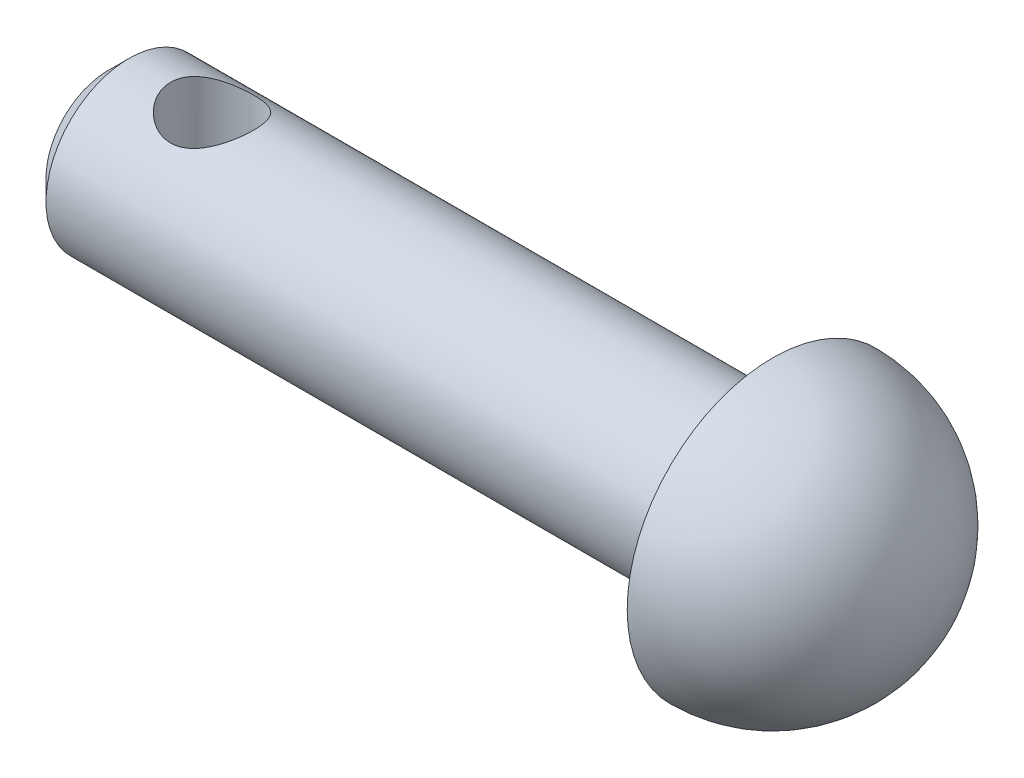
ISO-10303-21;
HEADER;
FILE_DESCRIPTION(('STEP AP214'),'2;1');
FILE_NAME('part.step','',(''),(''),'','','');
FILE_SCHEMA(('AUTOMOTIVE_DESIGN { 1 0 10303 214 1 1 1 1 }'));
ENDSEC;
DATA;
#1=APPLICATION_CONTEXT('core data for automotive mechanical design processes');
#2=APPLICATION_PROTOCOL_DEFINITION('international standard','automotive_design',2000,#1);
#3=PRODUCT_CONTEXT('',#1,'mechanical');
#4=PRODUCT('Part','Part','',(#3));
#5=PRODUCT_RELATED_PRODUCT_CATEGORY('part','',(#4));
#6=PRODUCT_DEFINITION_FORMATION('','',#4);
#7=PRODUCT_DEFINITION_CONTEXT('part definition',#1,'design');
#8=PRODUCT_DEFINITION('design','',#6,#7);
#9=PRODUCT_DEFINITION_SHAPE('','',#8);
#10=(LENGTH_UNIT() NAMED_UNIT(*) SI_UNIT(.MILLI.,.METRE.));
#11=(NAMED_UNIT(*) PLANE_ANGLE_UNIT() SI_UNIT($,.RADIAN.));
#12=(NAMED_UNIT(*) SI_UNIT($,.STERADIAN.) SOLID_ANGLE_UNIT());
#13=UNCERTAINTY_MEASURE_WITH_UNIT(LENGTH_MEASURE(1.E-05),#10,'distance_accuracy_value','');
#14=(GEOMETRIC_REPRESENTATION_CONTEXT(3) GLOBAL_UNCERTAINTY_ASSIGNED_CONTEXT((#13)) GLOBAL_UNIT_ASSIGNED_CONTEXT((#10,
#11,#12)) REPRESENTATION_CONTEXT('',''));
#15=CARTESIAN_POINT('',(0.,0.,0.));
#16=DIRECTION('',(0.,0.,1.));
#17=DIRECTION('',(1.,0.,0.));
#18=AXIS2_PLACEMENT_3D('',#15,#16,#17);
#19=CARTESIAN_POINT('',(16.,0.,0.));
#20=DIRECTION('',(-1.,0.,0.));
#21=DIRECTION('',(0.,0.,1.));
#22=AXIS2_PLACEMENT_3D('',#19,#20,#21);
#23=CYLINDRICAL_SURFACE('',#22,2.);
#24=CARTESIAN_POINT('',(1.5,-2.,0.));
#25=CARTESIAN_POINT('',(1.5000033023195,-1.99999713404151,0.0525719629529865));
#26=CARTESIAN_POINT('',(1.50417007312168,-1.99790491019518,0.105206599698033));
#27=CARTESIAN_POINT('',(1.52065288034092,-1.98974156037396,0.208920235268425));
#28=CARTESIAN_POINT('',(1.53298439299765,-1.98366287828984,0.259996086713504));
#29=CARTESIAN_POINT('',(1.56519380861679,-1.96816279403312,0.358933544880574));
#30=CARTESIAN_POINT('',(1.58504238424801,-1.9587543917752,0.40680680293918));
#31=CARTESIAN_POINT('',(1.63157062136494,-1.93745776515779,0.498472616806565));
#32=CARTESIAN_POINT('',(1.65824974424885,-1.9255697363353,0.54226549399005));
#33=CARTESIAN_POINT('',(1.7195172494853,-1.89956258258057,0.62750781776192));
#34=CARTESIAN_POINT('',(1.75448647923964,-1.88535199127536,0.668655211122112));
#35=CARTESIAN_POINT('',(1.83052147924703,-1.85659970246744,0.744779444866978));
#36=CARTESIAN_POINT('',(1.87159185177244,-1.84205776209035,0.779751583106767));
#37=CARTESIAN_POINT('',(1.96248334952338,-1.81298951197347,0.845252000450279));
#38=CARTESIAN_POINT('',(2.01273609834591,-1.79855186970132,0.875225335551638));
#39=CARTESIAN_POINT('',(2.11836733598622,-1.77285978772321,0.926168226890696));
#40=CARTESIAN_POINT('',(2.17374212872275,-1.7616030760699,0.947144214966334));
#41=CARTESIAN_POINT('',(2.28466510542192,-1.74457867037808,0.978132442188589));
#42=CARTESIAN_POINT('',(2.3400044520674,-1.73852271583714,0.988725857080441));
#43=CARTESIAN_POINT('',(2.45197883777948,-1.73181889948528,1.00042699330885));
#44=CARTESIAN_POINT('',(2.50861254087116,-1.73116569343288,1.00154408837307));
#45=CARTESIAN_POINT('',(2.61428602431537,-1.73510930257248,0.994687287172295));
#46=CARTESIAN_POINT('',(2.66342403122305,-1.73908763662014,0.987784559536822));
#47=CARTESIAN_POINT('',(2.75972190937304,-1.7507622873385,0.966939849056933));
#48=CARTESIAN_POINT('',(2.80688114530532,-1.75845978831776,0.952995623897652));
#49=CARTESIAN_POINT('',(2.89922913256566,-1.77687476412741,0.918209780386004));
#50=CARTESIAN_POINT('',(2.94434639878579,-1.78765840663999,0.897215067115995));
#51=CARTESIAN_POINT('',(3.03063429259001,-1.81103404281404,0.849041687668002));
#52=CARTESIAN_POINT('',(3.07180313560009,-1.82362684780191,0.821860243812467));
#53=CARTESIAN_POINT('',(3.15452125274323,-1.85113157903286,0.758066054912789));
#54=CARTESIAN_POINT('',(3.19545687357616,-1.86613510236746,0.720694458369282));
#55=CARTESIAN_POINT('',(3.2707354185909,-1.89547623300407,0.639555578741373));
#56=CARTESIAN_POINT('',(3.30507519203388,-1.90981351958801,0.595785256574285));
#57=CARTESIAN_POINT('',(3.36768566102973,-1.93701987282964,0.500516505831848));
#58=CARTESIAN_POINT('',(3.39560047244574,-1.94978984162007,0.448753591599408));
#59=CARTESIAN_POINT('',(3.44209702904301,-1.97157881121242,0.340466215488797));
#60=CARTESIAN_POINT('',(3.46068618501517,-1.98060078943553,0.283945576265276));
#61=CARTESIAN_POINT('',(3.48647540371668,-1.99324333741436,0.172766491660702));
#62=CARTESIAN_POINT('',(3.49449123574678,-1.99724938301312,0.118341530548324));
#63=CARTESIAN_POINT('',(3.50146473113449,-2.00073013459102,0.00877959994935378));
#64=CARTESIAN_POINT('',(3.50042668563948,-2.00020698721312,-0.0463570198699013));
#65=CARTESIAN_POINT('',(3.48979331158125,-1.99491192253441,-0.151232971985994));
#66=CARTESIAN_POINT('',(3.48086746726997,-1.9904724568819,-0.201059408049954));
#67=CARTESIAN_POINT('',(3.45576192810492,-1.97822171314819,-0.298406892301917));
#68=CARTESIAN_POINT('',(3.43958143354664,-1.97041006334332,-0.345927685690997));
#69=CARTESIAN_POINT('',(3.40000153356683,-1.95184251413669,-0.438888608449665));
#70=CARTESIAN_POINT('',(3.37640894988319,-1.94100881769939,-0.484230397006154));
#71=CARTESIAN_POINT('',(3.32289246435396,-1.91743974317109,-0.570461361698921));
#72=CARTESIAN_POINT('',(3.29296586540657,-1.90470355565785,-0.611348629775282));
#73=CARTESIAN_POINT('',(3.22423957466713,-1.87708221337464,-0.691767689290653));
#74=CARTESIAN_POINT('',(3.18485713154644,-1.86210884848441,-0.730772077824639));
#75=CARTESIAN_POINT('',(3.1000748487307,-1.83262391603874,-0.80185632111324));
#76=CARTESIAN_POINT('',(3.05467088118363,-1.81811267381526,-0.833931385690841));
#77=CARTESIAN_POINT('',(2.95635634579969,-1.79051192226068,-0.891707914497696));
#78=CARTESIAN_POINT('',(2.90318873379141,-1.77752529663472,-0.917025495878638));
#79=CARTESIAN_POINT('',(2.79248993230748,-1.75574072368126,-0.958082826013803));
#80=CARTESIAN_POINT('',(2.73496447349881,-1.74693738240618,-0.97383491588757));
#81=CARTESIAN_POINT('',(2.62308977713855,-1.73561501008667,-0.993861687449679));
#82=CARTESIAN_POINT('',(2.56896574657096,-1.73257383460491,-0.999092996400865));
#83=CARTESIAN_POINT('',(2.46055293282927,-1.73165354646175,-1.00068915438079));
#84=CARTESIAN_POINT('',(2.40626423126057,-1.73377219627553,-0.997057846624399));
#85=CARTESIAN_POINT('',(2.30451649846799,-1.74237862050025,-0.981926125592263));
#86=CARTESIAN_POINT('',(2.2568995298556,-1.74843094482394,-0.9712083143428));
#87=CARTESIAN_POINT('',(2.16419188057529,-1.76371016187918,-0.943175358224645));
#88=CARTESIAN_POINT('',(2.11910201790803,-1.77293807569676,-0.92585809115981));
#89=CARTESIAN_POINT('',(2.02937514901339,-1.79428530364528,-0.883815745300683));
#90=CARTESIAN_POINT('',(1.9849720981703,-1.80655722396191,-0.858671137816458));
#91=CARTESIAN_POINT('',(1.90072546381941,-1.8323533163459,-0.802150971636634));
#92=CARTESIAN_POINT('',(1.86088426948151,-1.84587813794522,-0.770772171238648));
#93=CARTESIAN_POINT('',(1.78185801764238,-1.87462323159313,-0.698203326664641));
#94=CARTESIAN_POINT('',(1.74334089763808,-1.88984983311469,-0.656284423010172));
#95=CARTESIAN_POINT('',(1.67373701657637,-1.91877752255088,-0.56615480622028));
#96=CARTESIAN_POINT('',(1.64265426057371,-1.9324777860804,-0.517940723256785));
#97=CARTESIAN_POINT('',(1.5887636372378,-1.95698009585103,-0.415931596819947));
#98=CARTESIAN_POINT('',(1.56601583058857,-1.96776096562909,-0.362099503934615));
#99=CARTESIAN_POINT('',(1.53019183208105,-1.98501341363465,-0.250742101294192));
#100=CARTESIAN_POINT('',(1.51708815317042,-1.99149723372932,-0.193227799623166));
#101=CARTESIAN_POINT('',(1.50610258892415,-1.99695461909663,-0.112601946483384));
#102=CARTESIAN_POINT('',(1.50381735913638,-1.99809365339202,-0.0901618794394987));
#103=CARTESIAN_POINT('',(1.50076533448319,-1.99961696977865,-0.0451517318071577));
#104=CARTESIAN_POINT('',(1.4999985815288,-2.00000123103763,-0.0225816476473814));
#105=CARTESIAN_POINT('',(1.5,-2.,0.));
#106=B_SPLINE_CURVE_WITH_KNOTS('',3,(#24,#25,#26,#27,#28,#29,#30,#31,#32,#33,#34,#35,#36,#37,
#38,#39,#40,#41,#42,#43,#44,#45,#46,#47,#48,#49,#50,#51,#52,#53,#54,#55,#56,#57,#58,#59,#60,#61,
#62,#63,#64,#65,#66,#67,#68,#69,#70,#71,#72,#73,#74,#75,#76,#77,#78,#79,#80,#81,#82,#83,#84,#85,
#86,#87,#88,#89,#90,#91,#92,#93,#94,#95,#96,#97,#98,#99,#100,#101,#102,#103,#104,#105),
.UNSPECIFIED.,.T.,.F.,(4,2,2,2,2,2,2,2,2,2,2,2,2,2,2,2,2,2,2,2,2,2,2,2,2,2,2,2,2,2,2,2,2,2,2,2,
2,2,2,2,4),(0.,0.157624257420293,0.315548149709198,0.472862155492298,0.630163760581568,
0.79698175871809,0.963926237654036,1.14381726430753,1.32357947898281,1.4925801214023,
1.6614135732902,1.81005712409321,1.95874803925679,2.11090240168487,2.26312521260222,
2.43464941333879,2.60625534598686,2.78583022214441,2.9652621691228,3.12983290471346,
3.29432564511476,3.44606906506122,3.59782921630932,3.75392856027899,3.91009450748339,
4.08159610644419,4.25321588615432,4.43314682159674,4.61284511940778,4.77529307498374,
4.93767059860005,5.08457930244183,5.23153528783678,5.38836456775614,5.54527561138958,
5.72125242752498,5.89732383376573,6.07464013662925,6.2514490862493,6.31915280137698,
6.38685838514847),.UNSPECIFIED.);
#107=CARTESIAN_POINT('',(1.5,-2.,0.));
#108=VERTEX_POINT('',#107);
#109=EDGE_CURVE('E10',#108,#108,#106,.T.);
#110=ORIENTED_EDGE('',*,*,#109,.T.);
#111=EDGE_LOOP('',(#110));
#112=FACE_BOUND('',#111,.T.);
#113=CARTESIAN_POINT('',(2.5,1.73205080756888,1.));
#114=CARTESIAN_POINT('',(2.44789219180475,1.73205534728459,0.999996363074532));
#115=CARTESIAN_POINT('',(2.39571858847495,1.73443801187756,0.995899970733217));
#116=CARTESIAN_POINT('',(2.29297273532285,1.74362366452052,0.979723209898053));
#117=CARTESIAN_POINT('',(2.24240408495659,1.75043594055559,0.967626064554179));
#118=CARTESIAN_POINT('',(2.14454833565606,1.76749346605398,0.936099948699812));
#119=CARTESIAN_POINT('',(2.09724534752641,1.77772043473252,0.916709952493731));
#120=CARTESIAN_POINT('',(2.00657579800328,1.80042664816858,0.871267525376372));
#121=CARTESIAN_POINT('',(1.96320944973754,1.81290601476065,0.845214734035773));
#122=CARTESIAN_POINT('',(1.87769427144249,1.83996869057441,0.784666540530879));
#123=CARTESIAN_POINT('',(1.83594086432646,1.85464063637954,0.749652036143771));
#124=CARTESIAN_POINT('',(1.75859161159329,1.88371982785706,0.673253807614468));
#125=CARTESIAN_POINT('',(1.72299883741648,1.8981269383125,0.631866925782293));
#126=CARTESIAN_POINT('',(1.65663284885234,1.92621476952949,0.540489563414546));
#127=CARTESIAN_POINT('',(1.62634623214047,1.93978106418172,0.490107189012575));
#128=CARTESIAN_POINT('',(1.57485914675424,1.96350756099529,0.384157026599504));
#129=CARTESIAN_POINT('',(1.55365294386283,1.97366991183742,0.328592538138155));
#130=CARTESIAN_POINT('',(1.5224953386989,1.98880461244237,0.218044943925977));
#131=CARTESIAN_POINT('',(1.51185047364447,1.99409480220892,0.163301790488817));
#132=CARTESIAN_POINT('',(1.49983388132496,2.00007583846067,0.0525706286978481));
#133=CARTESIAN_POINT('',(1.49845654320429,2.0007694678459,-0.00341660584373847));
#134=CARTESIAN_POINT('',(1.50474667397035,1.9976298191645,-0.10983252442375));
#135=CARTESIAN_POINT('',(1.51163801552122,1.9941849589216,-0.160321199176791));
#136=CARTESIAN_POINT('',(1.53288084390466,1.98374245259747,-0.259313771918322));
#137=CARTESIAN_POINT('',(1.54723288897622,1.97674454066394,-0.307817521093925));
#138=CARTESIAN_POINT('',(1.58308256608981,1.95971583287654,-0.402309391569554));
#139=CARTESIAN_POINT('',(1.60467631317207,1.94964441529199,-0.448253423515178));
#140=CARTESIAN_POINT('',(1.65426341620149,1.92737645986687,-0.535976801513329));
#141=CARTESIAN_POINT('',(1.68225906330235,1.91517916157484,-0.577754648838646));
#142=CARTESIAN_POINT('',(1.74689535153302,1.88844394399229,-0.660173660898195));
#143=CARTESIAN_POINT('',(1.78410302832601,1.87379375998175,-0.70033407502936));
#144=CARTESIAN_POINT('',(1.86458972493018,1.84454340586812,-0.77410437029778));
#145=CARTESIAN_POINT('',(1.90787337227406,1.82994328265629,-0.807709211574231));
#146=CARTESIAN_POINT('',(2.00264819242409,1.80144156092485,-0.869505334642211));
#147=CARTESIAN_POINT('',(2.05448602305421,1.78764319990708,-0.897217314978052));
#148=CARTESIAN_POINT('',(2.162937671359,1.76375450278576,-0.943319113001232));
#149=CARTESIAN_POINT('',(2.21954643301756,1.75366030046067,-0.96171865821089));
#150=CARTESIAN_POINT('',(2.33121451128279,1.73944635817034,-0.987180211025041));
#151=CARTESIAN_POINT('',(2.38604111904355,1.73491655848496,-0.995025122119976));
#152=CARTESIAN_POINT('',(2.49640134151654,1.73117919361609,-1.00151694661143));
#153=CARTESIAN_POINT('',(2.55193442911979,1.73196786889312,-1.00017035731503));
#154=CARTESIAN_POINT('',(2.65565391857873,1.73834336540585,-0.989036043343966));
#155=CARTESIAN_POINT('',(2.70397945110793,1.74339587506654,-0.980187816712467));
#156=CARTESIAN_POINT('',(2.79836778627096,1.75694021551341,-0.955696284632441));
#157=CARTESIAN_POINT('',(2.84442985074661,1.76543316005034,-0.940050778623615));
#158=CARTESIAN_POINT('',(2.9354113309027,1.78536222079657,-0.901647588604886));
#159=CARTESIAN_POINT('',(2.98017901685355,1.79691643243063,-0.878594063692724));
#160=CARTESIAN_POINT('',(3.06546927153899,1.8215611949725,-0.826287064015804));
#161=CARTESIAN_POINT('',(3.10598964351328,1.83465253355148,-0.797030404332216));
#162=CARTESIAN_POINT('',(3.18697876752355,1.86287998456336,-0.728837167198854));
#163=CARTESIAN_POINT('',(3.22679715071766,1.87806583154289,-0.689145272314967));
#164=CARTESIAN_POINT('',(3.29941223799359,1.90734234977892,-0.603404495398289));
#165=CARTESIAN_POINT('',(3.33220657023054,1.92143265007709,-0.557353474655347));
#166=CARTESIAN_POINT('',(3.3905737259501,1.94741361690957,-0.458535362558757));
#167=CARTESIAN_POINT('',(3.41593311821091,1.95923641672029,-0.405623097574113));
#168=CARTESIAN_POINT('',(3.45713790385739,1.97883354959301,-0.295522364641082));
#169=CARTESIAN_POINT('',(3.47299165136631,1.98661143676373,-0.238337701392176));
#170=CARTESIAN_POINT('',(3.49336856417466,1.99667508181883,-0.126979682330417));
#171=CARTESIAN_POINT('',(3.49879787587611,1.99939927908191,-0.0730114438504572));
#172=CARTESIAN_POINT('',(3.5008432654544,2.00042130375131,0.0351259859512035));
#173=CARTESIAN_POINT('',(3.49746242852356,1.9987206806689,0.0892951002950867));
#174=CARTESIAN_POINT('',(3.48258359320438,1.99133968837923,0.192537992317147));
#175=CARTESIAN_POINT('',(3.47163515074233,1.9859289466799,0.241712317811263));
#176=CARTESIAN_POINT('',(3.44267300069703,1.97192093663423,0.337445952183617));
#177=CARTESIAN_POINT('',(3.42465827990655,1.96332321132796,0.384004884955508));
#178=CARTESIAN_POINT('',(3.38127294783403,1.9432593074812,0.475423406244885));
#179=CARTESIAN_POINT('',(3.35562067679216,1.93168617198799,0.520125142700046));
#180=CARTESIAN_POINT('',(3.29804206914095,1.90688133141826,0.604774641814025));
#181=CARTESIAN_POINT('',(3.26611285088433,1.89364886558361,0.644720207414907));
#182=CARTESIAN_POINT('',(3.1932028609773,1.86528610226628,0.722914004156891));
#183=CARTESIAN_POINT('',(3.15163751252281,1.85009799011698,0.760597684539272));
#184=CARTESIAN_POINT('',(3.06254927887023,1.82063076162852,0.828663287394675));
#185=CARTESIAN_POINT('',(3.01502117913232,1.80635245761865,0.859038750010058));
#186=CARTESIAN_POINT('',(2.91336335341905,1.77999605304916,0.912431079785654));
#187=CARTESIAN_POINT('',(2.85907246887126,1.7680017425627,0.935185065960939));
#188=CARTESIAN_POINT('',(2.74666759566022,1.74866156328352,0.970878709506412));
#189=CARTESIAN_POINT('',(2.68856711108731,1.74130016147702,0.983851191175347));
#190=CARTESIAN_POINT('',(2.608194644348,1.7352927260179,0.994367007864415));
#191=CARTESIAN_POINT('',(2.58663210560212,1.73408129005152,0.996476104963851));
#192=CARTESIAN_POINT('',(2.54338351931776,1.7324593588775,0.999293405089963));
#193=CARTESIAN_POINT('',(2.52169746361413,1.73204891725109,1.00000151439987));
#194=CARTESIAN_POINT('',(2.5,1.73205080756888,1.));
#195=B_SPLINE_CURVE_WITH_KNOTS('',3,(#113,#114,#115,#116,#117,#118,#119,#120,#121,#122,#123,
#124,#125,#126,#127,#128,#129,#130,#131,#132,#133,#134,#135,#136,#137,#138,#139,#140,#141,#142,
#143,#144,#145,#146,#147,#148,#149,#150,#151,#152,#153,#154,#155,#156,#157,#158,#159,#160,#161,
#162,#163,#164,#165,#166,#167,#168,#169,#170,#171,#172,#173,#174,#175,#176,#177,#178,#179,#180,
#181,#182,#183,#184,#185,#186,#187,#188,#189,#190,#191,#192,#193,#194),.UNSPECIFIED.,.T.,.F.,(4,
2,2,2,2,2,2,2,2,2,2,2,2,2,2,2,2,2,2,2,2,2,2,2,2,2,2,2,2,2,2,2,2,2,2,2,2,2,2,2,4),(0.,
0.156232122594716,0.312792892824805,0.468528595918886,0.62427272544515,0.792862312498234,
0.96153571084371,1.14157892238763,1.32150826963891,1.48863484967935,1.6556602368604,
1.80816097484538,1.96067312517455,2.11529534731147,2.26997299350272,2.43927191456891,
2.60870048245919,2.78888841729448,2.96888774211705,3.13462290854212,3.30024093188373,
3.44774183424026,3.59529052436063,3.74967296406088,3.90413486220047,4.07806743580613,
4.25205864978202,4.43064181412966,4.60906779808772,4.77112270389487,4.93312086793972,
5.08444424871493,5.23578933512013,5.39360750719472,5.55149830100719,5.72510241850068,
5.89885942845154,6.07810749038605,6.2567513300276,6.32180135185309,6.38685572494541),.UNSPECIFIED.);
#196=CARTESIAN_POINT('',(2.5,1.73205080756888,1.));
#197=VERTEX_POINT('',#196);
#198=EDGE_CURVE('E54',#197,#197,#195,.T.);
#199=ORIENTED_EDGE('',*,*,#198,.T.);
#200=EDGE_LOOP('',(#199));
#201=FACE_BOUND('',#200,.T.);
#202=CARTESIAN_POINT('',(0.500000000000002,0.,0.));
#203=DIRECTION('',(1.,0.,0.));
#204=DIRECTION('',(0.,0.,-1.));
#205=AXIS2_PLACEMENT_3D('',#202,#203,#204);
#206=CIRCLE('',#205,2.);
#207=CARTESIAN_POINT('',(0.500000000000002,0.,-2.));
#208=VERTEX_POINT('',#207);
#209=EDGE_CURVE('E64',#208,#208,#206,.T.);
#210=ORIENTED_EDGE('',*,*,#209,.T.);
#211=EDGE_LOOP('',(#210));
#212=FACE_BOUND('',#211,.T.);
#213=CARTESIAN_POINT('',(16.,0.,0.));
#214=DIRECTION('',(1.,0.,0.));
#215=DIRECTION('',(0.,0.,-1.));
#216=AXIS2_PLACEMENT_3D('',#213,#214,#215);
#217=CIRCLE('',#216,2.);
#218=CARTESIAN_POINT('',(16.,0.,-2.));
#219=VERTEX_POINT('',#218);
#220=EDGE_CURVE('E94',#219,#219,#217,.T.);
#221=ORIENTED_EDGE('',*,*,#220,.F.);
#222=EDGE_LOOP('',(#221));
#223=FACE_BOUND('',#222,.T.);
#224=ADVANCED_FACE('F41',(#112,#201,#212,#223),#23,.T.);
#225=CARTESIAN_POINT('',(0.,0.,0.));
#226=DIRECTION('',(1.,0.,0.));
#227=DIRECTION('',(0.,0.,-1.));
#228=AXIS2_PLACEMENT_3D('',#225,#226,#227);
#229=PLANE('',#228);
#230=CARTESIAN_POINT('',(0.,0.,0.));
#231=DIRECTION('',(1.,0.,0.));
#232=DIRECTION('',(0.,0.,-1.));
#233=AXIS2_PLACEMENT_3D('',#230,#231,#232);
#234=CIRCLE('',#233,1.49999999999999);
#235=CARTESIAN_POINT('',(0.,0.,-1.49999999999999));
#236=VERTEX_POINT('',#235);
#237=EDGE_CURVE('E59',#236,#236,#234,.F.);
#238=ORIENTED_EDGE('',*,*,#237,.T.);
#239=EDGE_LOOP('',(#238));
#240=FACE_BOUND('',#239,.T.);
#241=ADVANCED_FACE('F79',(#240),#229,.F.);
#242=CARTESIAN_POINT('',(0.500000000000002,0.,0.));
#243=DIRECTION('',(1.,0.,0.));
#244=DIRECTION('',(0.,0.,-1.));
#245=AXIS2_PLACEMENT_3D('',#242,#243,#244);
#246=CONICAL_SURFACE('',#245,2.,0.785398163397452);
#247=ORIENTED_EDGE('',*,*,#237,.F.);
#248=EDGE_LOOP('',(#247));
#249=FACE_BOUND('',#248,.T.);
#250=ORIENTED_EDGE('',*,*,#209,.F.);
#251=EDGE_LOOP('',(#250));
#252=FACE_BOUND('',#251,.T.);
#253=ADVANCED_FACE('F44',(#249,#252),#246,.T.);
#254=CARTESIAN_POINT('',(2.5,-2.,0.));
#255=DIRECTION('',(0.,1.,0.));
#256=DIRECTION('',(0.,0.,1.));
#257=AXIS2_PLACEMENT_3D('',#254,#255,#256);
#258=CYLINDRICAL_SURFACE('',#257,1.);
#259=ORIENTED_EDGE('',*,*,#198,.F.);
#260=EDGE_LOOP('',(#259));
#261=FACE_BOUND('',#260,.T.);
#262=ORIENTED_EDGE('',*,*,#109,.F.);
#263=EDGE_LOOP('',(#262));
#264=FACE_BOUND('',#263,.T.);
#265=ADVANCED_FACE('F72',(#261,#264),#258,.F.);
#266=CARTESIAN_POINT('',(16.,0.,0.));
#267=DIRECTION('',(1.,0.,0.));
#268=DIRECTION('',(0.,0.,-1.));
#269=AXIS2_PLACEMENT_3D('',#266,#267,#268);
#270=PLANE('',#269);
#271=ORIENTED_EDGE('',*,*,#220,.T.);
#272=EDGE_LOOP('',(#271));
#273=FACE_BOUND('',#272,.T.);
#274=CARTESIAN_POINT('',(16.,0.,0.));
#275=DIRECTION('',(-1.,0.,0.));
#276=DIRECTION('',(0.,0.,1.));
#277=AXIS2_PLACEMENT_3D('',#274,#275,#276);
#278=CIRCLE('',#277,3.5);
#279=CARTESIAN_POINT('',(16.,0.,3.5));
#280=VERTEX_POINT('',#279);
#281=EDGE_CURVE('E97',#280,#280,#278,.T.);
#282=ORIENTED_EDGE('',*,*,#281,.T.);
#283=EDGE_LOOP('',(#282));
#284=FACE_BOUND('',#283,.T.);
#285=ADVANCED_FACE('F76',(#273,#284),#270,.F.);
#286=CARTESIAN_POINT('',(16.,0.,0.));
#287=DIRECTION('',(-1.,0.,0.));
#288=DIRECTION('',(0.,0.,1.));
#289=AXIS2_PLACEMENT_3D('',#286,#287,#288);
#290=SPHERICAL_SURFACE('',#289,3.5);
#291=ORIENTED_EDGE('',*,*,#281,.F.);
#292=EDGE_LOOP('',(#291));
#293=FACE_BOUND('',#292,.T.);
#294=ADVANCED_FACE('F105',(#293),#290,.T.);
#295=CLOSED_SHELL('',(#224,#241,#253,#265,#285,#294));
#296=MANIFOLD_SOLID_BREP('B2',#295);
#297=ADVANCED_BREP_SHAPE_REPRESENTATION('',(#18,#296),#14);
#298=SHAPE_DEFINITION_REPRESENTATION(#9,#297);
ENDSEC;
END-ISO-10303-21;
